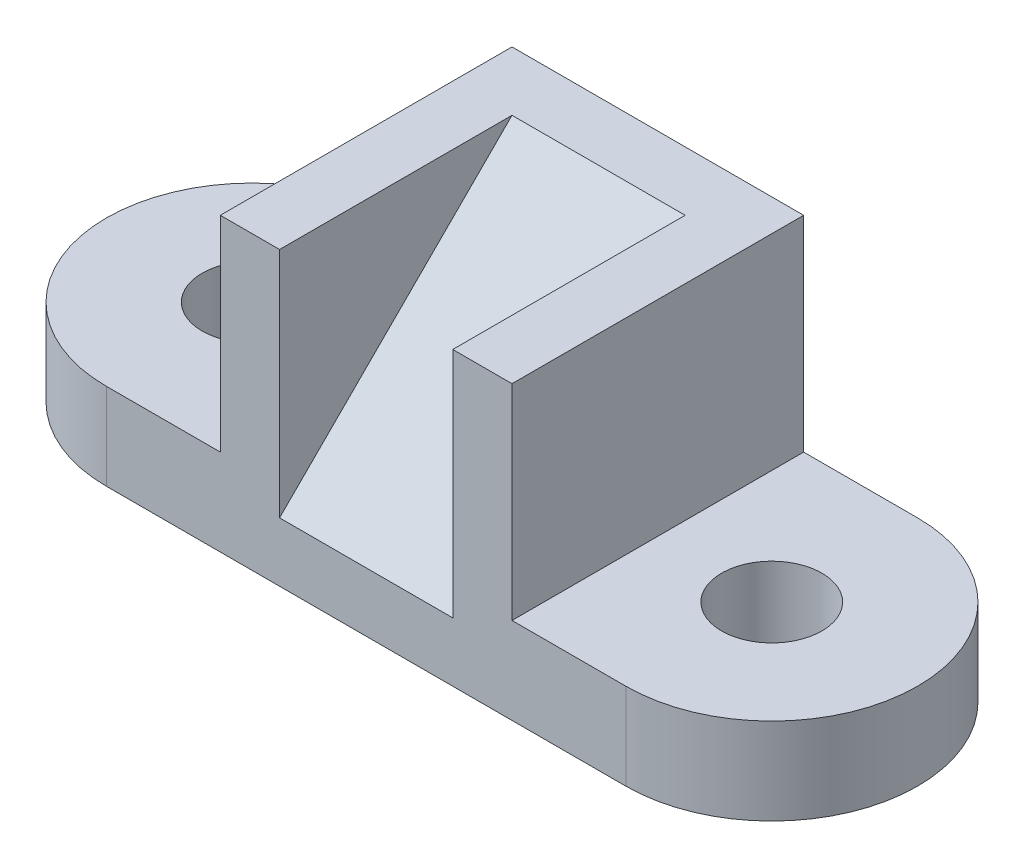
ISO-10303-21;
HEADER;
FILE_DESCRIPTION(('STEP AP214'),'2;1');
FILE_NAME('part.step','',(''),(''),'','','');
FILE_SCHEMA(('AUTOMOTIVE_DESIGN { 1 0 10303 214 1 1 1 1 }'));
ENDSEC;
DATA;
#1=APPLICATION_CONTEXT('core data for automotive mechanical design processes');
#2=APPLICATION_PROTOCOL_DEFINITION('international standard','automotive_design',2000,#1);
#3=PRODUCT_CONTEXT('',#1,'mechanical');
#4=PRODUCT('Part','Part','',(#3));
#5=PRODUCT_RELATED_PRODUCT_CATEGORY('part','',(#4));
#6=PRODUCT_DEFINITION_FORMATION('','',#4);
#7=PRODUCT_DEFINITION_CONTEXT('part definition',#1,'design');
#8=PRODUCT_DEFINITION('design','',#6,#7);
#9=PRODUCT_DEFINITION_SHAPE('','',#8);
#10=(LENGTH_UNIT() NAMED_UNIT(*) SI_UNIT(.MILLI.,.METRE.));
#11=(NAMED_UNIT(*) PLANE_ANGLE_UNIT() SI_UNIT($,.RADIAN.));
#12=(NAMED_UNIT(*) SI_UNIT($,.STERADIAN.) SOLID_ANGLE_UNIT());
#13=UNCERTAINTY_MEASURE_WITH_UNIT(LENGTH_MEASURE(1.E-05),#10,'distance_accuracy_value','');
#14=(GEOMETRIC_REPRESENTATION_CONTEXT(3) GLOBAL_UNCERTAINTY_ASSIGNED_CONTEXT((#13)) GLOBAL_UNIT_ASSIGNED_CONTEXT((#10,
#11,#12)) REPRESENTATION_CONTEXT('',''));
#15=CARTESIAN_POINT('',(0.,0.,0.));
#16=DIRECTION('',(0.,0.,1.));
#17=DIRECTION('',(1.,0.,0.));
#18=AXIS2_PLACEMENT_3D('',#15,#16,#17);
#19=CARTESIAN_POINT('',(38.,13.,-18.9999999999999));
#20=DIRECTION('',(-1.,0.,0.));
#21=DIRECTION('',(0.,0.,1.));
#22=AXIS2_PLACEMENT_3D('',#19,#20,#21);
#23=PLANE('',#22);
#24=DIRECTION('',(0.,0.707106781186548,-0.707106781186547));
#25=VECTOR('',#24,1.);
#26=CARTESIAN_POINT('',(38.,64.,-18.9999999999999));
#27=LINE('',#26,#25);
#28=CARTESIAN_POINT('',(38.,13.,32.));
#29=VERTEX_POINT('',#28);
#30=CARTESIAN_POINT('',(38.,64.,-18.9999999999999));
#31=VERTEX_POINT('',#30);
#32=EDGE_CURVE('E132',#29,#31,#27,.T.);
#33=ORIENTED_EDGE('',*,*,#32,.T.);
#34=DIRECTION('',(0.,0.,1.));
#35=VECTOR('',#34,1.);
#36=CARTESIAN_POINT('',(38.,64.,-18.9999999999999));
#37=LINE('',#36,#35);
#38=CARTESIAN_POINT('',(38.,64.,32.));
#39=VERTEX_POINT('',#38);
#40=EDGE_CURVE('E141',#31,#39,#37,.T.);
#41=ORIENTED_EDGE('',*,*,#40,.T.);
#42=DIRECTION('',(0.,1.,0.));
#43=VECTOR('',#42,1.);
#44=CARTESIAN_POINT('',(38.,13.,32.));
#45=LINE('',#44,#43);
#46=EDGE_CURVE('E123',#29,#39,#45,.T.);
#47=ORIENTED_EDGE('',*,*,#46,.F.);
#48=EDGE_LOOP('',(#33,#41,#47));
#49=FACE_BOUND('',#48,.T.);
#50=ADVANCED_FACE('F33',(#49),#23,.F.);
#51=CARTESIAN_POINT('',(76.,13.,-18.9999999999999));
#52=DIRECTION('',(1.,0.,0.));
#53=DIRECTION('',(0.,0.,-1.));
#54=AXIS2_PLACEMENT_3D('',#51,#52,#53);
#55=PLANE('',#54);
#56=DIRECTION('',(0.,0.707106781186548,-0.707106781186547));
#57=VECTOR('',#56,1.);
#58=CARTESIAN_POINT('',(76.,64.,-18.9999999999999));
#59=LINE('',#58,#57);
#60=CARTESIAN_POINT('',(76.,13.,32.));
#61=VERTEX_POINT('',#60);
#62=CARTESIAN_POINT('',(76.,64.,-18.9999999999999));
#63=VERTEX_POINT('',#62);
#64=EDGE_CURVE('E126',#61,#63,#59,.T.);
#65=ORIENTED_EDGE('',*,*,#64,.F.);
#66=DIRECTION('',(0.,1.,0.));
#67=VECTOR('',#66,1.);
#68=CARTESIAN_POINT('',(76.,13.,32.));
#69=LINE('',#68,#67);
#70=CARTESIAN_POINT('',(76.,64.,32.));
#71=VERTEX_POINT('',#70);
#72=EDGE_CURVE('E48',#61,#71,#69,.T.);
#73=ORIENTED_EDGE('',*,*,#72,.T.);
#74=DIRECTION('',(0.,0.,-1.));
#75=VECTOR('',#74,1.);
#76=CARTESIAN_POINT('',(76.,64.,-18.9999999999999));
#77=LINE('',#76,#75);
#78=EDGE_CURVE('E128',#71,#63,#77,.T.);
#79=ORIENTED_EDGE('',*,*,#78,.T.);
#80=EDGE_LOOP('',(#65,#73,#79));
#81=FACE_BOUND('',#80,.T.);
#82=ADVANCED_FACE('F127',(#81),#55,.F.);
#83=CARTESIAN_POINT('',(0.,19.,0.));
#84=DIRECTION('',(0.,1.,0.));
#85=DIRECTION('',(0.,0.,1.));
#86=AXIS2_PLACEMENT_3D('',#83,#84,#85);
#87=PLANE('',#86);
#88=DIRECTION('',(0.,0.,1.));
#89=VECTOR('',#88,1.);
#90=CARTESIAN_POINT('',(25.,19.,-32.));
#91=LINE('',#90,#89);
#92=CARTESIAN_POINT('',(25.,19.,-32.));
#93=VERTEX_POINT('',#92);
#94=CARTESIAN_POINT('',(25.,19.,32.));
#95=VERTEX_POINT('',#94);
#96=EDGE_CURVE('E56',#93,#95,#91,.T.);
#97=ORIENTED_EDGE('',*,*,#96,.F.);
#98=DIRECTION('',(-1.,0.,0.));
#99=VECTOR('',#98,1.);
#100=CARTESIAN_POINT('',(0.,19.,-32.));
#101=LINE('',#100,#99);
#102=CARTESIAN_POINT('',(0.,19.,-32.));
#103=VERTEX_POINT('',#102);
#104=EDGE_CURVE('E192',#93,#103,#101,.T.);
#105=ORIENTED_EDGE('',*,*,#104,.T.);
#106=CARTESIAN_POINT('',(0.,19.,0.));
#107=DIRECTION('',(0.,1.,0.));
#108=DIRECTION('',(0.,0.,1.));
#109=AXIS2_PLACEMENT_3D('',#106,#107,#108);
#110=CIRCLE('',#109,32.);
#111=CARTESIAN_POINT('',(0.,19.,32.));
#112=VERTEX_POINT('',#111);
#113=EDGE_CURVE('E183',#103,#112,#110,.T.);
#114=ORIENTED_EDGE('',*,*,#113,.T.);
#115=DIRECTION('',(1.,0.,0.));
#116=VECTOR('',#115,1.);
#117=CARTESIAN_POINT('',(0.,19.,32.));
#118=LINE('',#117,#116);
#119=EDGE_CURVE('E188',#112,#95,#118,.T.);
#120=ORIENTED_EDGE('',*,*,#119,.T.);
#121=EDGE_LOOP('',(#97,#105,#114,#120));
#122=FACE_BOUND('',#121,.T.);
#123=CARTESIAN_POINT('',(0.,19.,0.));
#124=DIRECTION('',(0.,1.,0.));
#125=DIRECTION('',(0.,0.,1.));
#126=AXIS2_PLACEMENT_3D('',#123,#124,#125);
#127=CIRCLE('',#126,11.);
#128=CARTESIAN_POINT('',(0.,19.,11.));
#129=VERTEX_POINT('',#128);
#130=EDGE_CURVE('E175',#129,#129,#127,.T.);
#131=ORIENTED_EDGE('',*,*,#130,.F.);
#132=EDGE_LOOP('',(#131));
#133=FACE_BOUND('',#132,.T.);
#134=ADVANCED_FACE('F226',(#122,#133),#87,.T.);
#135=CARTESIAN_POINT('',(0.,19.,0.));
#136=DIRECTION('',(0.,-1.,0.));
#137=DIRECTION('',(0.,0.,-1.));
#138=AXIS2_PLACEMENT_3D('',#135,#136,#137);
#139=CYLINDRICAL_SURFACE('',#138,32.);
#140=CARTESIAN_POINT('',(0.,0.,0.));
#141=DIRECTION('',(0.,1.,0.));
#142=DIRECTION('',(0.,0.,1.));
#143=AXIS2_PLACEMENT_3D('',#140,#141,#142);
#144=CIRCLE('',#143,32.);
#145=CARTESIAN_POINT('',(0.,0.,-32.));
#146=VERTEX_POINT('',#145);
#147=CARTESIAN_POINT('',(0.,0.,32.));
#148=VERTEX_POINT('',#147);
#149=EDGE_CURVE('E174',#146,#148,#144,.T.);
#150=ORIENTED_EDGE('',*,*,#149,.T.);
#151=DIRECTION('',(0.,-1.,0.));
#152=VECTOR('',#151,1.);
#153=CARTESIAN_POINT('',(0.,19.,32.));
#154=LINE('',#153,#152);
#155=EDGE_CURVE('E11',#112,#148,#154,.T.);
#156=ORIENTED_EDGE('',*,*,#155,.F.);
#157=ORIENTED_EDGE('',*,*,#113,.F.);
#158=DIRECTION('',(0.,-1.,0.));
#159=VECTOR('',#158,1.);
#160=CARTESIAN_POINT('',(0.,19.,-32.));
#161=LINE('',#160,#159);
#162=EDGE_CURVE('E195',#103,#146,#161,.T.);
#163=ORIENTED_EDGE('',*,*,#162,.T.);
#164=EDGE_LOOP('',(#150,#156,#157,#163));
#165=FACE_BOUND('',#164,.T.);
#166=ADVANCED_FACE('F35',(#165),#139,.T.);
#167=CARTESIAN_POINT('',(0.,19.,32.));
#168=DIRECTION('',(0.,0.,-1.));
#169=DIRECTION('',(-1.,0.,0.));
#170=AXIS2_PLACEMENT_3D('',#167,#168,#169);
#171=PLANE('',#170);
#172=DIRECTION('',(1.,0.,0.));
#173=VECTOR('',#172,1.);
#174=CARTESIAN_POINT('',(38.,13.,32.));
#175=LINE('',#174,#173);
#176=EDGE_CURVE('E119',#29,#61,#175,.T.);
#177=ORIENTED_EDGE('',*,*,#176,.F.);
#178=ORIENTED_EDGE('',*,*,#46,.T.);
#179=DIRECTION('',(1.,0.,0.));
#180=VECTOR('',#179,1.);
#181=CARTESIAN_POINT('',(89.,64.,32.));
#182=LINE('',#181,#180);
#183=CARTESIAN_POINT('',(25.,64.,32.));
#184=VERTEX_POINT('',#183);
#185=EDGE_CURVE('E148',#184,#39,#182,.T.);
#186=ORIENTED_EDGE('',*,*,#185,.F.);
#187=DIRECTION('',(0.,-1.,0.));
#188=VECTOR('',#187,1.);
#189=CARTESIAN_POINT('',(25.,64.,32.));
#190=LINE('',#189,#188);
#191=EDGE_CURVE('E167',#184,#95,#190,.T.);
#192=ORIENTED_EDGE('',*,*,#191,.T.);
#193=ORIENTED_EDGE('',*,*,#119,.F.);
#194=ORIENTED_EDGE('',*,*,#155,.T.);
#195=DIRECTION('',(1.,0.,0.));
#196=VECTOR('',#195,1.);
#197=CARTESIAN_POINT('',(0.,0.,32.));
#198=LINE('',#197,#196);
#199=CARTESIAN_POINT('',(114.,0.,32.));
#200=VERTEX_POINT('',#199);
#201=EDGE_CURVE('E198',#148,#200,#198,.T.);
#202=ORIENTED_EDGE('',*,*,#201,.T.);
#203=DIRECTION('',(0.,-1.,0.));
#204=VECTOR('',#203,1.);
#205=CARTESIAN_POINT('',(114.,19.,32.));
#206=LINE('',#205,#204);
#207=CARTESIAN_POINT('',(114.,19.,32.));
#208=VERTEX_POINT('',#207);
#209=EDGE_CURVE('E41',#208,#200,#206,.T.);
#210=ORIENTED_EDGE('',*,*,#209,.F.);
#211=CARTESIAN_POINT('',(89.,19.,32.));
#212=VERTEX_POINT('',#211);
#213=EDGE_CURVE('E186',#212,#208,#118,.T.);
#214=ORIENTED_EDGE('',*,*,#213,.F.);
#215=DIRECTION('',(0.,-1.,0.));
#216=VECTOR('',#215,1.);
#217=CARTESIAN_POINT('',(89.,64.,32.));
#218=LINE('',#217,#216);
#219=CARTESIAN_POINT('',(89.,64.,32.));
#220=VERTEX_POINT('',#219);
#221=EDGE_CURVE('E164',#220,#212,#218,.T.);
#222=ORIENTED_EDGE('',*,*,#221,.F.);
#223=EDGE_CURVE('E122',#71,#220,#182,.T.);
#224=ORIENTED_EDGE('',*,*,#223,.F.);
#225=ORIENTED_EDGE('',*,*,#72,.F.);
#226=EDGE_LOOP('',(#177,#178,#186,#192,#193,#194,#202,#210,#214,#222,#224,#225));
#227=FACE_BOUND('',#226,.T.);
#228=ADVANCED_FACE('F116',(#227),#171,.F.);
#229=CARTESIAN_POINT('',(114.,19.,0.));
#230=DIRECTION('',(0.,-1.,0.));
#231=DIRECTION('',(0.,0.,-1.));
#232=AXIS2_PLACEMENT_3D('',#229,#230,#231);
#233=CYLINDRICAL_SURFACE('',#232,32.);
#234=CARTESIAN_POINT('',(114.,0.,0.));
#235=DIRECTION('',(0.,1.,0.));
#236=DIRECTION('',(0.,0.,1.));
#237=AXIS2_PLACEMENT_3D('',#234,#235,#236);
#238=CIRCLE('',#237,32.);
#239=CARTESIAN_POINT('',(114.,0.,-32.));
#240=VERTEX_POINT('',#239);
#241=EDGE_CURVE('E200',#200,#240,#238,.T.);
#242=ORIENTED_EDGE('',*,*,#241,.T.);
#243=DIRECTION('',(0.,-1.,0.));
#244=VECTOR('',#243,1.);
#245=CARTESIAN_POINT('',(114.,19.,-32.));
#246=LINE('',#245,#244);
#247=CARTESIAN_POINT('',(114.,19.,-32.));
#248=VERTEX_POINT('',#247);
#249=EDGE_CURVE('E205',#248,#240,#246,.T.);
#250=ORIENTED_EDGE('',*,*,#249,.F.);
#251=CARTESIAN_POINT('',(114.,19.,0.));
#252=DIRECTION('',(0.,1.,0.));
#253=DIRECTION('',(0.,0.,1.));
#254=AXIS2_PLACEMENT_3D('',#251,#252,#253);
#255=CIRCLE('',#254,32.);
#256=EDGE_CURVE('E190',#208,#248,#255,.T.);
#257=ORIENTED_EDGE('',*,*,#256,.F.);
#258=ORIENTED_EDGE('',*,*,#209,.T.);
#259=EDGE_LOOP('',(#242,#250,#257,#258));
#260=FACE_BOUND('',#259,.T.);
#261=ADVANCED_FACE('F212',(#260),#233,.T.);
#262=CARTESIAN_POINT('',(0.,19.,-32.));
#263=DIRECTION('',(0.,0.,1.));
#264=DIRECTION('',(1.,0.,0.));
#265=AXIS2_PLACEMENT_3D('',#262,#263,#264);
#266=PLANE('',#265);
#267=DIRECTION('',(-1.,0.,0.));
#268=VECTOR('',#267,1.);
#269=CARTESIAN_POINT('',(0.,0.,-32.));
#270=LINE('',#269,#268);
#271=EDGE_CURVE('E187',#240,#146,#270,.T.);
#272=ORIENTED_EDGE('',*,*,#271,.T.);
#273=ORIENTED_EDGE('',*,*,#162,.F.);
#274=ORIENTED_EDGE('',*,*,#104,.F.);
#275=DIRECTION('',(0.,-1.,0.));
#276=VECTOR('',#275,1.);
#277=CARTESIAN_POINT('',(25.,64.,-32.));
#278=LINE('',#277,#276);
#279=CARTESIAN_POINT('',(25.,64.,-32.));
#280=VERTEX_POINT('',#279);
#281=EDGE_CURVE('E155',#280,#93,#278,.T.);
#282=ORIENTED_EDGE('',*,*,#281,.F.);
#283=DIRECTION('',(-1.,0.,0.));
#284=VECTOR('',#283,1.);
#285=CARTESIAN_POINT('',(89.0000000000001,64.,-32.));
#286=LINE('',#285,#284);
#287=CARTESIAN_POINT('',(89.0000000000001,64.,-32.));
#288=VERTEX_POINT('',#287);
#289=EDGE_CURVE('E153',#288,#280,#286,.T.);
#290=ORIENTED_EDGE('',*,*,#289,.F.);
#291=DIRECTION('',(0.,-1.,0.));
#292=VECTOR('',#291,1.);
#293=CARTESIAN_POINT('',(89.0000000000001,64.,-32.));
#294=LINE('',#293,#292);
#295=CARTESIAN_POINT('',(89.0000000000001,19.,-32.));
#296=VERTEX_POINT('',#295);
#297=EDGE_CURVE('E161',#288,#296,#294,.T.);
#298=ORIENTED_EDGE('',*,*,#297,.T.);
#299=EDGE_CURVE('E193',#248,#296,#101,.T.);
#300=ORIENTED_EDGE('',*,*,#299,.F.);
#301=ORIENTED_EDGE('',*,*,#249,.T.);
#302=EDGE_LOOP('',(#272,#273,#274,#282,#290,#298,#300,#301));
#303=FACE_BOUND('',#302,.T.);
#304=ADVANCED_FACE('F221',(#303),#266,.F.);
#305=DIRECTION('',(0.,0.,-1.));
#306=VECTOR('',#305,1.);
#307=CARTESIAN_POINT('',(89.0000000000001,19.,-32.));
#308=LINE('',#307,#306);
#309=EDGE_CURVE('E147',#212,#296,#308,.T.);
#310=ORIENTED_EDGE('',*,*,#309,.F.);
#311=ORIENTED_EDGE('',*,*,#213,.T.);
#312=ORIENTED_EDGE('',*,*,#256,.T.);
#313=ORIENTED_EDGE('',*,*,#299,.T.);
#314=EDGE_LOOP('',(#310,#311,#312,#313));
#315=FACE_BOUND('',#314,.T.);
#316=CARTESIAN_POINT('',(114.,19.,0.));
#317=DIRECTION('',(0.,1.,0.));
#318=DIRECTION('',(0.,0.,1.));
#319=AXIS2_PLACEMENT_3D('',#316,#317,#318);
#320=CIRCLE('',#319,11.);
#321=CARTESIAN_POINT('',(114.,19.,11.));
#322=VERTEX_POINT('',#321);
#323=EDGE_CURVE('E170',#322,#322,#320,.T.);
#324=ORIENTED_EDGE('',*,*,#323,.F.);
#325=EDGE_LOOP('',(#324));
#326=FACE_BOUND('',#325,.T.);
#327=ADVANCED_FACE('F242',(#315,#326),#87,.T.);
#328=CARTESIAN_POINT('',(0.,0.,0.));
#329=DIRECTION('',(0.,1.,0.));
#330=DIRECTION('',(0.,0.,1.));
#331=AXIS2_PLACEMENT_3D('',#328,#329,#330);
#332=PLANE('',#331);
#333=CARTESIAN_POINT('',(0.,0.,0.));
#334=DIRECTION('',(0.,1.,0.));
#335=DIRECTION('',(0.,0.,1.));
#336=AXIS2_PLACEMENT_3D('',#333,#334,#335);
#337=CIRCLE('',#336,11.);
#338=CARTESIAN_POINT('',(0.,0.,11.));
#339=VERTEX_POINT('',#338);
#340=EDGE_CURVE('E171',#339,#339,#337,.T.);
#341=ORIENTED_EDGE('',*,*,#340,.T.);
#342=EDGE_LOOP('',(#341));
#343=FACE_BOUND('',#342,.T.);
#344=CARTESIAN_POINT('',(114.,0.,0.));
#345=DIRECTION('',(0.,1.,0.));
#346=DIRECTION('',(0.,0.,1.));
#347=AXIS2_PLACEMENT_3D('',#344,#345,#346);
#348=CIRCLE('',#347,11.);
#349=CARTESIAN_POINT('',(114.,0.,11.));
#350=VERTEX_POINT('',#349);
#351=EDGE_CURVE('E178',#350,#350,#348,.T.);
#352=ORIENTED_EDGE('',*,*,#351,.T.);
#353=EDGE_LOOP('',(#352));
#354=FACE_BOUND('',#353,.T.);
#355=ORIENTED_EDGE('',*,*,#149,.F.);
#356=ORIENTED_EDGE('',*,*,#271,.F.);
#357=ORIENTED_EDGE('',*,*,#241,.F.);
#358=ORIENTED_EDGE('',*,*,#201,.F.);
#359=EDGE_LOOP('',(#355,#356,#357,#358));
#360=FACE_BOUND('',#359,.T.);
#361=ADVANCED_FACE('F218',(#343,#354,#360),#332,.F.);
#362=CARTESIAN_POINT('',(114.,0.,0.));
#363=DIRECTION('',(0.,1.,0.));
#364=DIRECTION('',(0.,0.,1.));
#365=AXIS2_PLACEMENT_3D('',#362,#363,#364);
#366=CYLINDRICAL_SURFACE('',#365,11.);
#367=ORIENTED_EDGE('',*,*,#351,.F.);
#368=EDGE_LOOP('',(#367));
#369=FACE_BOUND('',#368,.T.);
#370=ORIENTED_EDGE('',*,*,#323,.T.);
#371=EDGE_LOOP('',(#370));
#372=FACE_BOUND('',#371,.T.);
#373=ADVANCED_FACE('F248',(#369,#372),#366,.F.);
#374=CARTESIAN_POINT('',(0.,0.,0.));
#375=DIRECTION('',(0.,1.,0.));
#376=DIRECTION('',(0.,0.,1.));
#377=AXIS2_PLACEMENT_3D('',#374,#375,#376);
#378=CYLINDRICAL_SURFACE('',#377,11.);
#379=ORIENTED_EDGE('',*,*,#340,.F.);
#380=EDGE_LOOP('',(#379));
#381=FACE_BOUND('',#380,.T.);
#382=ORIENTED_EDGE('',*,*,#130,.T.);
#383=EDGE_LOOP('',(#382));
#384=FACE_BOUND('',#383,.T.);
#385=ADVANCED_FACE('F250',(#381,#384),#378,.F.);
#386=CARTESIAN_POINT('',(25.,64.,-32.));
#387=DIRECTION('',(1.,0.,0.));
#388=DIRECTION('',(0.,0.,-1.));
#389=AXIS2_PLACEMENT_3D('',#386,#387,#388);
#390=PLANE('',#389);
#391=ORIENTED_EDGE('',*,*,#96,.T.);
#392=ORIENTED_EDGE('',*,*,#191,.F.);
#393=DIRECTION('',(0.,0.,1.));
#394=VECTOR('',#393,1.);
#395=CARTESIAN_POINT('',(25.,64.,-32.));
#396=LINE('',#395,#394);
#397=EDGE_CURVE('E144',#280,#184,#396,.T.);
#398=ORIENTED_EDGE('',*,*,#397,.F.);
#399=ORIENTED_EDGE('',*,*,#281,.T.);
#400=EDGE_LOOP('',(#391,#392,#398,#399));
#401=FACE_BOUND('',#400,.T.);
#402=ADVANCED_FACE('F232',(#401),#390,.F.);
#403=CARTESIAN_POINT('',(89.0000000000001,64.,-32.));
#404=DIRECTION('',(-1.,0.,0.));
#405=DIRECTION('',(0.,0.,1.));
#406=AXIS2_PLACEMENT_3D('',#403,#404,#405);
#407=PLANE('',#406);
#408=ORIENTED_EDGE('',*,*,#309,.T.);
#409=ORIENTED_EDGE('',*,*,#297,.F.);
#410=DIRECTION('',(0.,0.,-1.));
#411=VECTOR('',#410,1.);
#412=CARTESIAN_POINT('',(89.0000000000001,64.,-32.));
#413=LINE('',#412,#411);
#414=EDGE_CURVE('E151',#220,#288,#413,.T.);
#415=ORIENTED_EDGE('',*,*,#414,.F.);
#416=ORIENTED_EDGE('',*,*,#221,.T.);
#417=EDGE_LOOP('',(#408,#409,#415,#416));
#418=FACE_BOUND('',#417,.T.);
#419=ADVANCED_FACE('F240',(#418),#407,.F.);
#420=CARTESIAN_POINT('',(0.,64.,0.));
#421=DIRECTION('',(0.,-1.,0.));
#422=DIRECTION('',(0.,0.,-1.));
#423=AXIS2_PLACEMENT_3D('',#420,#421,#422);
#424=PLANE('',#423);
#425=ORIENTED_EDGE('',*,*,#185,.T.);
#426=ORIENTED_EDGE('',*,*,#40,.F.);
#427=DIRECTION('',(-1.,0.,0.));
#428=VECTOR('',#427,1.);
#429=CARTESIAN_POINT('',(38.,64.,-18.9999999999999));
#430=LINE('',#429,#428);
#431=EDGE_CURVE('E135',#63,#31,#430,.T.);
#432=ORIENTED_EDGE('',*,*,#431,.F.);
#433=ORIENTED_EDGE('',*,*,#78,.F.);
#434=ORIENTED_EDGE('',*,*,#223,.T.);
#435=ORIENTED_EDGE('',*,*,#414,.T.);
#436=ORIENTED_EDGE('',*,*,#289,.T.);
#437=ORIENTED_EDGE('',*,*,#397,.T.);
#438=EDGE_LOOP('',(#425,#426,#432,#433,#434,#435,#436,#437));
#439=FACE_BOUND('',#438,.T.);
#440=ADVANCED_FACE('F235',(#439),#424,.F.);
#441=CARTESIAN_POINT('',(38.,64.,-18.9999999999999));
#442=DIRECTION('',(0.,-0.707106781186547,-0.707106781186548));
#443=DIRECTION('',(0.,0.707106781186548,-0.707106781186547));
#444=AXIS2_PLACEMENT_3D('',#441,#442,#443);
#445=PLANE('',#444);
#446=ORIENTED_EDGE('',*,*,#64,.T.);
#447=ORIENTED_EDGE('',*,*,#431,.T.);
#448=ORIENTED_EDGE('',*,*,#32,.F.);
#449=ORIENTED_EDGE('',*,*,#176,.T.);
#450=EDGE_LOOP('',(#446,#447,#448,#449));
#451=FACE_BOUND('',#450,.T.);
#452=ADVANCED_FACE('F134',(#451),#445,.F.);
#453=CLOSED_SHELL('',(#50,#82,#134,#166,#228,#261,#304,#327,#361,#373,#385,#402,#419,#440,#452));
#454=MANIFOLD_SOLID_BREP('B2',#453);
#455=ADVANCED_BREP_SHAPE_REPRESENTATION('',(#18,#454),#14);
#456=SHAPE_DEFINITION_REPRESENTATION(#9,#455);
ENDSEC;
END-ISO-10303-21;
